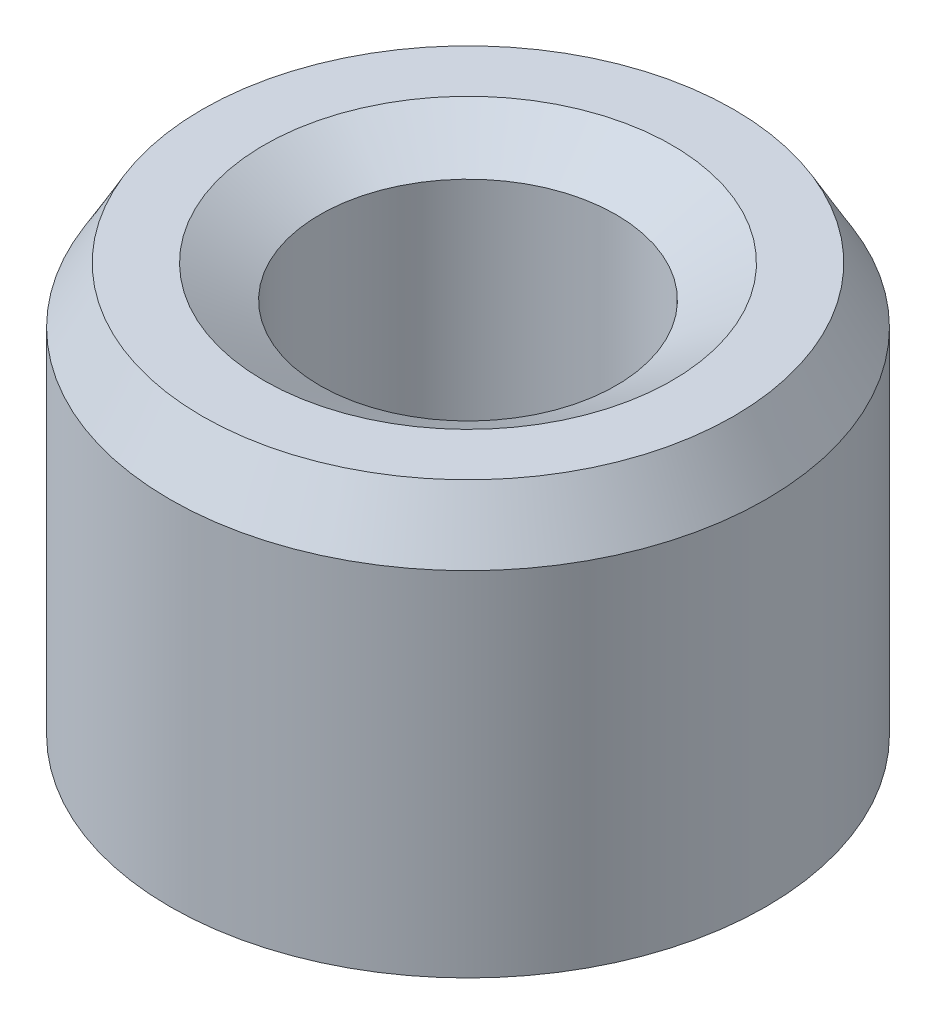
ISO-10303-21;
HEADER;
FILE_DESCRIPTION(('STEP AP214'),'2;1');
FILE_NAME('part.step','',(''),(''),'','','');
FILE_SCHEMA(('AUTOMOTIVE_DESIGN { 1 0 10303 214 1 1 1 1 }'));
ENDSEC;
DATA;
#1=APPLICATION_CONTEXT('core data for automotive mechanical design processes');
#2=APPLICATION_PROTOCOL_DEFINITION('international standard','automotive_design',2000,#1);
#3=PRODUCT_CONTEXT('',#1,'mechanical');
#4=PRODUCT('Part','Part','',(#3));
#5=PRODUCT_RELATED_PRODUCT_CATEGORY('part','',(#4));
#6=PRODUCT_DEFINITION_FORMATION('','',#4);
#7=PRODUCT_DEFINITION_CONTEXT('part definition',#1,'design');
#8=PRODUCT_DEFINITION('design','',#6,#7);
#9=PRODUCT_DEFINITION_SHAPE('','',#8);
#10=(LENGTH_UNIT() NAMED_UNIT(*) SI_UNIT(.MILLI.,.METRE.));
#11=(NAMED_UNIT(*) PLANE_ANGLE_UNIT() SI_UNIT($,.RADIAN.));
#12=(NAMED_UNIT(*) SI_UNIT($,.STERADIAN.) SOLID_ANGLE_UNIT());
#13=UNCERTAINTY_MEASURE_WITH_UNIT(LENGTH_MEASURE(1.E-05),#10,'distance_accuracy_value','');
#14=(GEOMETRIC_REPRESENTATION_CONTEXT(3) GLOBAL_UNCERTAINTY_ASSIGNED_CONTEXT((#13)) GLOBAL_UNIT_ASSIGNED_CONTEXT((#10,
#11,#12)) REPRESENTATION_CONTEXT('',''));
#15=CARTESIAN_POINT('',(0.,0.,0.));
#16=DIRECTION('',(0.,0.,1.));
#17=DIRECTION('',(1.,0.,0.));
#18=AXIS2_PLACEMENT_3D('',#15,#16,#17);
#19=CARTESIAN_POINT('',(0.,14.7944019377645,0.));
#20=DIRECTION('',(0.,-1.,0.));
#21=DIRECTION('',(0.,0.,-1.));
#22=AXIS2_PLACEMENT_3D('',#19,#20,#21);
#23=CYLINDRICAL_SURFACE('',#22,10.);
#24=CARTESIAN_POINT('',(0.,1.08292354798561,0.));
#25=DIRECTION('',(0.,1.,0.));
#26=DIRECTION('',(0.,0.,1.));
#27=AXIS2_PLACEMENT_3D('',#24,#25,#26);
#28=CIRCLE('',#27,10.);
#29=CARTESIAN_POINT('',(0.,1.08292354798561,10.));
#30=VERTEX_POINT('',#29);
#31=EDGE_CURVE('E10',#30,#30,#28,.T.);
#32=ORIENTED_EDGE('',*,*,#31,.T.);
#33=EDGE_LOOP('',(#32));
#34=FACE_BOUND('',#33,.T.);
#35=CARTESIAN_POINT('',(0.,12.9187233319406,0.));
#36=DIRECTION('',(0.,1.,0.));
#37=DIRECTION('',(0.,0.,1.));
#38=AXIS2_PLACEMENT_3D('',#35,#36,#37);
#39=CIRCLE('',#38,10.);
#40=CARTESIAN_POINT('',(0.,12.9187233319406,-10.));
#41=VERTEX_POINT('',#40);
#42=EDGE_CURVE('E50',#41,#41,#39,.F.);
#43=ORIENTED_EDGE('',*,*,#42,.T.);
#44=EDGE_LOOP('',(#43));
#45=FACE_BOUND('',#44,.T.);
#46=ADVANCED_FACE('F39',(#34,#45),#23,.T.);
#47=CARTESIAN_POINT('',(0.,14.7944019377645,0.));
#48=DIRECTION('',(0.,1.,0.));
#49=DIRECTION('',(0.,0.,1.));
#50=AXIS2_PLACEMENT_3D('',#47,#48,#49);
#51=PLANE('',#50);
#52=CARTESIAN_POINT('',(0.,14.7944019377645,0.));
#53=DIRECTION('',(0.,1.,0.));
#54=DIRECTION('',(0.,0.,1.));
#55=AXIS2_PLACEMENT_3D('',#52,#53,#54);
#56=CIRCLE('',#55,6.84544284261101);
#57=CARTESIAN_POINT('',(0.,14.7944019377645,6.84544284261101));
#58=VERTEX_POINT('',#57);
#59=EDGE_CURVE('E58',#58,#58,#56,.F.);
#60=ORIENTED_EDGE('',*,*,#59,.T.);
#61=EDGE_LOOP('',(#60));
#62=FACE_BOUND('',#61,.T.);
#63=CARTESIAN_POINT('',(0.,14.7944019377645,0.));
#64=DIRECTION('',(0.,1.,0.));
#65=DIRECTION('',(0.,0.,1.));
#66=AXIS2_PLACEMENT_3D('',#63,#64,#65);
#67=CIRCLE('',#66,8.91707645201439);
#68=CARTESIAN_POINT('',(0.,14.7944019377645,-8.91707645201439));
#69=VERTEX_POINT('',#68);
#70=EDGE_CURVE('E61',#69,#69,#67,.T.);
#71=ORIENTED_EDGE('',*,*,#70,.T.);
#72=EDGE_LOOP('',(#71));
#73=FACE_BOUND('',#72,.T.);
#74=ADVANCED_FACE('F88',(#62,#73),#51,.T.);
#75=CARTESIAN_POINT('',(0.,0.,0.));
#76=DIRECTION('',(0.,1.,0.));
#77=DIRECTION('',(0.,0.,1.));
#78=AXIS2_PLACEMENT_3D('',#75,#76,#77);
#79=PLANE('',#78);
#80=CARTESIAN_POINT('',(0.,0.,0.));
#81=DIRECTION('',(0.,1.,0.));
#82=DIRECTION('',(0.,0.,1.));
#83=AXIS2_PLACEMENT_3D('',#80,#81,#82);
#84=CIRCLE('',#83,6.05268778477277);
#85=CARTESIAN_POINT('',(0.,0.,6.05268778477277));
#86=VERTEX_POINT('',#85);
#87=EDGE_CURVE('E51',#86,#86,#84,.T.);
#88=ORIENTED_EDGE('',*,*,#87,.T.);
#89=EDGE_LOOP('',(#88));
#90=FACE_BOUND('',#89,.T.);
#91=CARTESIAN_POINT('',(0.,0.,0.));
#92=DIRECTION('',(0.,1.,0.));
#93=DIRECTION('',(0.,0.,1.));
#94=AXIS2_PLACEMENT_3D('',#91,#92,#93);
#95=CIRCLE('',#94,8.12432139417615);
#96=CARTESIAN_POINT('',(0.,0.,8.12432139417615));
#97=VERTEX_POINT('',#96);
#98=EDGE_CURVE('E54',#97,#97,#95,.F.);
#99=ORIENTED_EDGE('',*,*,#98,.T.);
#100=EDGE_LOOP('',(#99));
#101=FACE_BOUND('',#100,.T.);
#102=ADVANCED_FACE('F83',(#90,#101),#79,.F.);
#103=CARTESIAN_POINT('',(0.,14.7944019377645,0.));
#104=DIRECTION('',(0.,-1.,0.));
#105=DIRECTION('',(0.,0.,-1.));
#106=AXIS2_PLACEMENT_3D('',#103,#104,#105);
#107=CYLINDRICAL_SURFACE('',#106,4.96976423678716);
#108=CARTESIAN_POINT('',(0.,13.7114783897788,0.));
#109=DIRECTION('',(0.,1.,0.));
#110=DIRECTION('',(0.,0.,1.));
#111=AXIS2_PLACEMENT_3D('',#108,#109,#110);
#112=CIRCLE('',#111,4.96976423678716);
#113=CARTESIAN_POINT('',(0.,13.7114783897788,4.96976423678716));
#114=VERTEX_POINT('',#113);
#115=EDGE_CURVE('E67',#114,#114,#112,.T.);
#116=ORIENTED_EDGE('',*,*,#115,.T.);
#117=EDGE_LOOP('',(#116));
#118=FACE_BOUND('',#117,.T.);
#119=CARTESIAN_POINT('',(0.,1.87567860582384,0.));
#120=DIRECTION('',(0.,1.,0.));
#121=DIRECTION('',(0.,0.,1.));
#122=AXIS2_PLACEMENT_3D('',#119,#120,#121);
#123=CIRCLE('',#122,4.96976423678716);
#124=CARTESIAN_POINT('',(0.,1.87567860582384,4.96976423678716));
#125=VERTEX_POINT('',#124);
#126=EDGE_CURVE('E69',#125,#125,#123,.F.);
#127=ORIENTED_EDGE('',*,*,#126,.T.);
#128=EDGE_LOOP('',(#127));
#129=FACE_BOUND('',#128,.T.);
#130=ADVANCED_FACE('F71',(#118,#129),#107,.F.);
#131=CARTESIAN_POINT('',(0.,13.7114783897788,0.));
#132=DIRECTION('',(0.,1.,0.));
#133=DIRECTION('',(0.,0.,1.));
#134=AXIS2_PLACEMENT_3D('',#131,#132,#133);
#135=CONICAL_SURFACE('',#134,4.96976423678716,1.0471975511966);
#136=ORIENTED_EDGE('',*,*,#59,.F.);
#137=EDGE_LOOP('',(#136));
#138=FACE_BOUND('',#137,.T.);
#139=ORIENTED_EDGE('',*,*,#115,.F.);
#140=EDGE_LOOP('',(#139));
#141=FACE_BOUND('',#140,.T.);
#142=ADVANCED_FACE('F77',(#138,#141),#135,.F.);
#143=CARTESIAN_POINT('',(0.,0.,0.));
#144=DIRECTION('',(0.,-1.,0.));
#145=DIRECTION('',(0.,0.,-1.));
#146=AXIS2_PLACEMENT_3D('',#143,#144,#145);
#147=CONICAL_SURFACE('',#146,6.05268778477277,0.523598775598295);
#148=ORIENTED_EDGE('',*,*,#126,.F.);
#149=EDGE_LOOP('',(#148));
#150=FACE_BOUND('',#149,.T.);
#151=ORIENTED_EDGE('',*,*,#87,.F.);
#152=EDGE_LOOP('',(#151));
#153=FACE_BOUND('',#152,.T.);
#154=ADVANCED_FACE('F73',(#150,#153),#147,.F.);
#155=CARTESIAN_POINT('',(0.,1.08292354798561,0.));
#156=DIRECTION('',(0.,1.,0.));
#157=DIRECTION('',(0.,0.,1.));
#158=AXIS2_PLACEMENT_3D('',#155,#156,#157);
#159=CONICAL_SURFACE('',#158,10.,1.0471975511966);
#160=ORIENTED_EDGE('',*,*,#98,.F.);
#161=EDGE_LOOP('',(#160));
#162=FACE_BOUND('',#161,.T.);
#163=ORIENTED_EDGE('',*,*,#31,.F.);
#164=EDGE_LOOP('',(#163));
#165=FACE_BOUND('',#164,.T.);
#166=ADVANCED_FACE('F76',(#162,#165),#159,.T.);
#167=CARTESIAN_POINT('',(0.,14.7944019377645,0.));
#168=DIRECTION('',(0.,-1.,0.));
#169=DIRECTION('',(0.,0.,-1.));
#170=AXIS2_PLACEMENT_3D('',#167,#168,#169);
#171=CONICAL_SURFACE('',#170,8.91707645201439,0.523598775598295);
#172=CARTESIAN_POINT('',(0.,12.9187233319406,-10.));
#173=CARTESIAN_POINT('',(0.,12.9382616507513,-9.98871954637515));
#174=CARTESIAN_POINT('',(0.,12.9577999695619,-9.9774390927503));
#175=CARTESIAN_POINT('',(0.,12.9968766071833,-9.9548781855006));
#176=CARTESIAN_POINT('',(0.,13.0164149259939,-9.94359773187575));
#177=CARTESIAN_POINT('',(0.,13.0554915636153,-9.92103682462605));
#178=CARTESIAN_POINT('',(0.,13.0750298824259,-9.9097563710012));
#179=CARTESIAN_POINT('',(0.,13.1141065200473,-9.8871954637515));
#180=CARTESIAN_POINT('',(0.,13.1336448388579,-9.87591501012665));
#181=CARTESIAN_POINT('',(0.,13.1727214764792,-9.85335410287695));
#182=CARTESIAN_POINT('',(0.,13.1922597952899,-9.8420736492521));
#183=CARTESIAN_POINT('',(0.,13.2313364329112,-9.8195127420024));
#184=CARTESIAN_POINT('',(0.,13.2508747517219,-9.80823228837755));
#185=CARTESIAN_POINT('',(0.,13.2899513893432,-9.78567138112785));
#186=CARTESIAN_POINT('',(0.,13.3094897081539,-9.774390927503));
#187=CARTESIAN_POINT('',(0.,13.3485663457752,-9.7518300202533));
#188=CARTESIAN_POINT('',(0.,13.3681046645859,-9.74054956662845));
#189=CARTESIAN_POINT('',(0.,13.4071813022072,-9.71798865937875));
#190=CARTESIAN_POINT('',(0.,13.4267196210179,-9.7067082057539));
#191=CARTESIAN_POINT('',(0.,13.4657962586392,-9.6841472985042));
#192=CARTESIAN_POINT('',(0.,13.4853345774499,-9.67286684487935));
#193=CARTESIAN_POINT('',(0.,13.5244112150712,-9.65030593762965));
#194=CARTESIAN_POINT('',(0.,13.5439495338819,-9.6390254840048));
#195=CARTESIAN_POINT('',(0.,13.5830261715032,-9.6164645767551));
#196=CARTESIAN_POINT('',(0.,13.6025644903139,-9.60518412313025));
#197=CARTESIAN_POINT('',(0.,13.6416411279352,-9.58262321588055));
#198=CARTESIAN_POINT('',(0.,13.6611794467459,-9.5713427622557));
#199=CARTESIAN_POINT('',(0.,13.7002560843672,-9.548781855006));
#200=CARTESIAN_POINT('',(0.,13.7197944031779,-9.53750140138115));
#201=CARTESIAN_POINT('',(0.,13.7588710407992,-9.51494049413145));
#202=CARTESIAN_POINT('',(0.,13.7784093596099,-9.5036600405066));
#203=CARTESIAN_POINT('',(0.,13.8174859972312,-9.4810991332569));
#204=CARTESIAN_POINT('',(0.,13.8370243160419,-9.46981867963204));
#205=CARTESIAN_POINT('',(0.,13.8761009536632,-9.44725777238235));
#206=CARTESIAN_POINT('',(0.,13.8956392724739,-9.43597731875749));
#207=CARTESIAN_POINT('',(0.,13.9347159100952,-9.41341641150779));
#208=CARTESIAN_POINT('',(0.,13.9542542289059,-9.40213595788294));
#209=CARTESIAN_POINT('',(0.,13.9933308665272,-9.37957505063324));
#210=CARTESIAN_POINT('',(0.,14.0128691853379,-9.36829459700839));
#211=CARTESIAN_POINT('',(0.,14.0519458229592,-9.34573368975869));
#212=CARTESIAN_POINT('',(0.,14.0714841417698,-9.33445323613384));
#213=CARTESIAN_POINT('',(0.,14.1105607793912,-9.31189232888414));
#214=CARTESIAN_POINT('',(0.,14.1300990982018,-9.30061187525929));
#215=CARTESIAN_POINT('',(0.,14.1691757358232,-9.27805096800959));
#216=CARTESIAN_POINT('',(0.,14.1887140546338,-9.26677051438474));
#217=CARTESIAN_POINT('',(0.,14.2277906922552,-9.24420960713504));
#218=CARTESIAN_POINT('',(0.,14.2473290110658,-9.23292915351019));
#219=CARTESIAN_POINT('',(0.,14.2864056486872,-9.21036824626049));
#220=CARTESIAN_POINT('',(0.,14.3059439674978,-9.19908779263564));
#221=CARTESIAN_POINT('',(0.,14.3450206051192,-9.17652688538594));
#222=CARTESIAN_POINT('',(0.,14.3645589239298,-9.16524643176109));
#223=CARTESIAN_POINT('',(0.,14.4036355615512,-9.14268552451139));
#224=CARTESIAN_POINT('',(0.,14.4231738803618,-9.13140507088654));
#225=CARTESIAN_POINT('',(0.,14.4622505179832,-9.10884416363684));
#226=CARTESIAN_POINT('',(0.,14.4817888367938,-9.09756371001199));
#227=CARTESIAN_POINT('',(0.,14.5208654744151,-9.07500280276229));
#228=CARTESIAN_POINT('',(0.,14.5404037932258,-9.06372234913744));
#229=CARTESIAN_POINT('',(0.,14.5794804308471,-9.04116144188774));
#230=CARTESIAN_POINT('',(0.,14.5990187496578,-9.02988098826289));
#231=CARTESIAN_POINT('',(0.,14.6380953872791,-9.00732008101319));
#232=CARTESIAN_POINT('',(0.,14.6576337060898,-8.99603962738834));
#233=CARTESIAN_POINT('',(0.,14.6967103437111,-8.97347872013864));
#234=CARTESIAN_POINT('',(0.,14.7162486625218,-8.96219826651379));
#235=CARTESIAN_POINT('',(0.,14.7553253001431,-8.93963735926409));
#236=CARTESIAN_POINT('',(0.,14.7748636189538,-8.92835690563924));
#237=CARTESIAN_POINT('',(0.,14.7944019377645,-8.91707645201439));
#238=B_SPLINE_CURVE_WITH_KNOTS('',3,(#172,#173,#174,#175,#176,#177,#178,#179,#180,#181,#182,
#183,#184,#185,#186,#187,#188,#189,#190,#191,#192,#193,#194,#195,#196,#197,#198,#199,#200,#201,
#202,#203,#204,#205,#206,#207,#208,#209,#210,#211,#212,#213,#214,#215,#216,#217,#218,#219,#220,
#221,#222,#223,#224,#225,#226,#227,#228,#229,#230,#231,#232,#233,#234,#235,#236,#237),
.UNSPECIFIED.,.F.,.F.,(4,2,2,2,2,2,2,2,2,2,2,2,2,2,2,2,2,2,2,2,2,2,2,2,2,2,2,2,2,2,2,2,4),(0.,
0.0676827217491013,0.135365443498203,0.203048165247304,0.270730886996406,0.338413608745508,
0.406096330494608,0.47377905224371,0.541461773992811,0.609144495741913,0.676827217491014,
0.744509939240116,0.812192660989218,0.879875382738319,0.947558104487419,1.01524082623652,
1.08292354798562,1.15060626973472,1.21828899148383,1.28597171323293,1.35365443498203,
1.42133715673113,1.48901987848023,1.55670260022933,1.62438532197844,1.69206804372754,
1.75975076547664,1.82743348722574,1.89511620897484,1.96279893072394,2.03048165247304,
2.09816437422214,2.16584709597125),.UNSPECIFIED.);
#239=EDGE_CURVE('BSEAM45',#41,#69,#238,.T.);
#240=ORIENTED_EDGE('',*,*,#42,.F.);
#241=ORIENTED_EDGE('',*,*,#70,.F.);
#242=ORIENTED_EDGE('',*,*,#239,.T.);
#243=ORIENTED_EDGE('',*,*,#239,.F.);
#244=EDGE_LOOP('',(#240,#242,#241,#243));
#245=FACE_BOUND('',#244,.T.);
#246=ADVANCED_FACE('F45',(#245),#171,.T.);
#247=CLOSED_SHELL('',(#46,#74,#102,#130,#142,#154,#166,#246));
#248=MANIFOLD_SOLID_BREP('B2',#247);
#249=ADVANCED_BREP_SHAPE_REPRESENTATION('',(#18,#248),#14);
#250=SHAPE_DEFINITION_REPRESENTATION(#9,#249);
ENDSEC;
END-ISO-10303-21;
